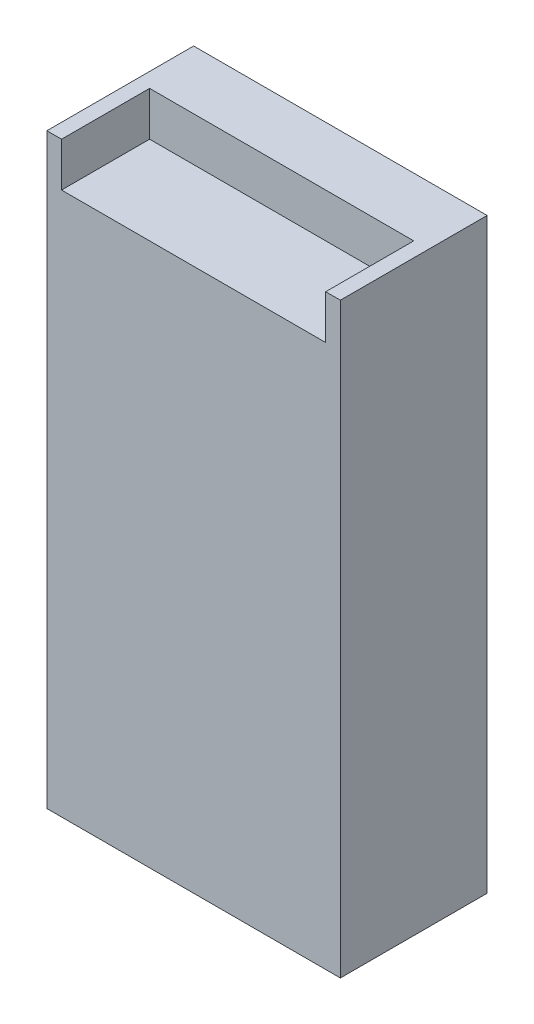
ISO-10303-21;
HEADER;
FILE_DESCRIPTION(('STEP AP214'),'2;1');
FILE_NAME('part.step','',(''),(''),'','','');
FILE_SCHEMA(('AUTOMOTIVE_DESIGN { 1 0 10303 214 1 1 1 1 }'));
ENDSEC;
DATA;
#1=APPLICATION_CONTEXT('core data for automotive mechanical design processes');
#2=APPLICATION_PROTOCOL_DEFINITION('international standard','automotive_design',2000,#1);
#3=PRODUCT_CONTEXT('',#1,'mechanical');
#4=PRODUCT('Part','Part','',(#3));
#5=PRODUCT_RELATED_PRODUCT_CATEGORY('part','',(#4));
#6=PRODUCT_DEFINITION_FORMATION('','',#4);
#7=PRODUCT_DEFINITION_CONTEXT('part definition',#1,'design');
#8=PRODUCT_DEFINITION('design','',#6,#7);
#9=PRODUCT_DEFINITION_SHAPE('','',#8);
#10=(LENGTH_UNIT() NAMED_UNIT(*) SI_UNIT(.MILLI.,.METRE.));
#11=(NAMED_UNIT(*) PLANE_ANGLE_UNIT() SI_UNIT($,.RADIAN.));
#12=(NAMED_UNIT(*) SI_UNIT($,.STERADIAN.) SOLID_ANGLE_UNIT());
#13=UNCERTAINTY_MEASURE_WITH_UNIT(LENGTH_MEASURE(1.E-05),#10,'distance_accuracy_value','');
#14=(GEOMETRIC_REPRESENTATION_CONTEXT(3) GLOBAL_UNCERTAINTY_ASSIGNED_CONTEXT((#13)) GLOBAL_UNIT_ASSIGNED_CONTEXT((#10,
#11,#12)) REPRESENTATION_CONTEXT('',''));
#15=CARTESIAN_POINT('',(0.,0.,0.));
#16=DIRECTION('',(0.,0.,1.));
#17=DIRECTION('',(1.,0.,0.));
#18=AXIS2_PLACEMENT_3D('',#15,#16,#17);
#19=CARTESIAN_POINT('',(0.,0.,50.));
#20=DIRECTION('',(1.,0.,0.));
#21=DIRECTION('',(0.,0.,-1.));
#22=AXIS2_PLACEMENT_3D('',#19,#20,#21);
#23=PLANE('',#22);
#24=DIRECTION('',(0.,-1.,0.));
#25=VECTOR('',#24,1.);
#26=CARTESIAN_POINT('',(0.,0.,0.));
#27=LINE('',#26,#25);
#28=CARTESIAN_POINT('',(0.,200.,0.));
#29=VERTEX_POINT('',#28);
#30=CARTESIAN_POINT('',(0.,0.,0.));
#31=VERTEX_POINT('',#30);
#32=EDGE_CURVE('E137',#29,#31,#27,.T.);
#33=ORIENTED_EDGE('',*,*,#32,.T.);
#34=DIRECTION('',(0.,0.,-1.));
#35=VECTOR('',#34,1.);
#36=CARTESIAN_POINT('',(0.,0.,50.));
#37=LINE('',#36,#35);
#38=CARTESIAN_POINT('',(0.,0.,50.));
#39=VERTEX_POINT('',#38);
#40=EDGE_CURVE('E11',#39,#31,#37,.T.);
#41=ORIENTED_EDGE('',*,*,#40,.F.);
#42=DIRECTION('',(0.,-1.,0.));
#43=VECTOR('',#42,1.);
#44=CARTESIAN_POINT('',(0.,0.,50.));
#45=LINE('',#44,#43);
#46=CARTESIAN_POINT('',(0.,200.,50.));
#47=VERTEX_POINT('',#46);
#48=EDGE_CURVE('E142',#47,#39,#45,.T.);
#49=ORIENTED_EDGE('',*,*,#48,.F.);
#50=DIRECTION('',(0.,0.,-1.));
#51=VECTOR('',#50,1.);
#52=CARTESIAN_POINT('',(0.,200.,50.));
#53=LINE('',#52,#51);
#54=EDGE_CURVE('E150',#47,#29,#53,.T.);
#55=ORIENTED_EDGE('',*,*,#54,.T.);
#56=EDGE_LOOP('',(#33,#41,#49,#55));
#57=FACE_BOUND('',#56,.T.);
#58=ADVANCED_FACE('F33',(#57),#23,.F.);
#59=CARTESIAN_POINT('',(0.,0.,50.));
#60=DIRECTION('',(0.,1.,0.));
#61=DIRECTION('',(0.,0.,1.));
#62=AXIS2_PLACEMENT_3D('',#59,#60,#61);
#63=PLANE('',#62);
#64=DIRECTION('',(1.,0.,0.));
#65=VECTOR('',#64,1.);
#66=CARTESIAN_POINT('',(0.,0.,0.));
#67=LINE('',#66,#65);
#68=CARTESIAN_POINT('',(100.,0.,0.));
#69=VERTEX_POINT('',#68);
#70=EDGE_CURVE('E153',#31,#69,#67,.T.);
#71=ORIENTED_EDGE('',*,*,#70,.T.);
#72=DIRECTION('',(0.,0.,-1.));
#73=VECTOR('',#72,1.);
#74=CARTESIAN_POINT('',(100.,0.,50.));
#75=LINE('',#74,#73);
#76=CARTESIAN_POINT('',(100.,0.,50.));
#77=VERTEX_POINT('',#76);
#78=EDGE_CURVE('E40',#77,#69,#75,.T.);
#79=ORIENTED_EDGE('',*,*,#78,.F.);
#80=DIRECTION('',(1.,0.,0.));
#81=VECTOR('',#80,1.);
#82=CARTESIAN_POINT('',(0.,0.,50.));
#83=LINE('',#82,#81);
#84=EDGE_CURVE('E84',#39,#77,#83,.T.);
#85=ORIENTED_EDGE('',*,*,#84,.F.);
#86=ORIENTED_EDGE('',*,*,#40,.T.);
#87=EDGE_LOOP('',(#71,#79,#85,#86));
#88=FACE_BOUND('',#87,.T.);
#89=ADVANCED_FACE('F188',(#88),#63,.F.);
#90=CARTESIAN_POINT('',(100.,0.,50.));
#91=DIRECTION('',(-1.,0.,0.));
#92=DIRECTION('',(0.,0.,1.));
#93=AXIS2_PLACEMENT_3D('',#90,#91,#92);
#94=PLANE('',#93);
#95=DIRECTION('',(0.,1.,0.));
#96=VECTOR('',#95,1.);
#97=CARTESIAN_POINT('',(100.,0.,0.));
#98=LINE('',#97,#96);
#99=CARTESIAN_POINT('',(100.,200.,0.));
#100=VERTEX_POINT('',#99);
#101=EDGE_CURVE('E155',#69,#100,#98,.T.);
#102=ORIENTED_EDGE('',*,*,#101,.T.);
#103=DIRECTION('',(0.,0.,-1.));
#104=VECTOR('',#103,1.);
#105=CARTESIAN_POINT('',(100.,200.,50.));
#106=LINE('',#105,#104);
#107=CARTESIAN_POINT('',(100.,200.,50.));
#108=VERTEX_POINT('',#107);
#109=EDGE_CURVE('E159',#108,#100,#106,.T.);
#110=ORIENTED_EDGE('',*,*,#109,.F.);
#111=DIRECTION('',(0.,1.,0.));
#112=VECTOR('',#111,1.);
#113=CARTESIAN_POINT('',(100.,0.,50.));
#114=LINE('',#113,#112);
#115=EDGE_CURVE('E145',#77,#108,#114,.T.);
#116=ORIENTED_EDGE('',*,*,#115,.F.);
#117=ORIENTED_EDGE('',*,*,#78,.T.);
#118=EDGE_LOOP('',(#102,#110,#116,#117));
#119=FACE_BOUND('',#118,.T.);
#120=ADVANCED_FACE('F164',(#119),#94,.F.);
#121=CARTESIAN_POINT('',(0.,200.,50.));
#122=DIRECTION('',(0.,-1.,0.));
#123=DIRECTION('',(0.,0.,-1.));
#124=AXIS2_PLACEMENT_3D('',#121,#122,#123);
#125=PLANE('',#124);
#126=DIRECTION('',(-1.,0.,0.));
#127=VECTOR('',#126,1.);
#128=CARTESIAN_POINT('',(0.,200.,50.));
#129=LINE('',#128,#127);
#130=CARTESIAN_POINT('',(5.,200.,50.));
#131=VERTEX_POINT('',#130);
#132=EDGE_CURVE('E55',#131,#47,#129,.T.);
#133=ORIENTED_EDGE('',*,*,#132,.F.);
#134=DIRECTION('',(0.,0.,1.));
#135=VECTOR('',#134,1.);
#136=CARTESIAN_POINT('',(5.,200.,20.));
#137=LINE('',#136,#135);
#138=CARTESIAN_POINT('',(5.,200.,20.));
#139=VERTEX_POINT('',#138);
#140=EDGE_CURVE('E135',#139,#131,#137,.T.);
#141=ORIENTED_EDGE('',*,*,#140,.F.);
#142=DIRECTION('',(-1.,0.,0.));
#143=VECTOR('',#142,1.);
#144=CARTESIAN_POINT('',(5.,200.,20.));
#145=LINE('',#144,#143);
#146=CARTESIAN_POINT('',(95.,200.,20.));
#147=VERTEX_POINT('',#146);
#148=EDGE_CURVE('E113',#147,#139,#145,.T.);
#149=ORIENTED_EDGE('',*,*,#148,.F.);
#150=DIRECTION('',(0.,0.,1.));
#151=VECTOR('',#150,1.);
#152=CARTESIAN_POINT('',(95.,200.,20.));
#153=LINE('',#152,#151);
#154=CARTESIAN_POINT('',(95.,200.,50.));
#155=VERTEX_POINT('',#154);
#156=EDGE_CURVE('E138',#147,#155,#153,.T.);
#157=ORIENTED_EDGE('',*,*,#156,.T.);
#158=EDGE_CURVE('E147',#108,#155,#129,.T.);
#159=ORIENTED_EDGE('',*,*,#158,.F.);
#160=ORIENTED_EDGE('',*,*,#109,.T.);
#161=DIRECTION('',(-1.,0.,0.));
#162=VECTOR('',#161,1.);
#163=CARTESIAN_POINT('',(0.,200.,0.));
#164=LINE('',#163,#162);
#165=EDGE_CURVE('E77',#100,#29,#164,.T.);
#166=ORIENTED_EDGE('',*,*,#165,.T.);
#167=ORIENTED_EDGE('',*,*,#54,.F.);
#168=EDGE_LOOP('',(#133,#141,#149,#157,#159,#160,#166,#167));
#169=FACE_BOUND('',#168,.T.);
#170=ADVANCED_FACE('F172',(#169),#125,.F.);
#171=CARTESIAN_POINT('',(0.,0.,50.));
#172=DIRECTION('',(0.,0.,-1.));
#173=DIRECTION('',(-1.,0.,0.));
#174=AXIS2_PLACEMENT_3D('',#171,#172,#173);
#175=PLANE('',#174);
#176=DIRECTION('',(1.,0.,0.));
#177=VECTOR('',#176,1.);
#178=CARTESIAN_POINT('',(5.,185.,50.));
#179=LINE('',#178,#177);
#180=CARTESIAN_POINT('',(5.,185.,50.));
#181=VERTEX_POINT('',#180);
#182=CARTESIAN_POINT('',(95.,185.,50.));
#183=VERTEX_POINT('',#182);
#184=EDGE_CURVE('E128',#181,#183,#179,.T.);
#185=ORIENTED_EDGE('',*,*,#184,.F.);
#186=DIRECTION('',(0.,-1.,0.));
#187=VECTOR('',#186,1.);
#188=CARTESIAN_POINT('',(5.,200.,50.));
#189=LINE('',#188,#187);
#190=EDGE_CURVE('E47',#131,#181,#189,.T.);
#191=ORIENTED_EDGE('',*,*,#190,.F.);
#192=ORIENTED_EDGE('',*,*,#132,.T.);
#193=ORIENTED_EDGE('',*,*,#48,.T.);
#194=ORIENTED_EDGE('',*,*,#84,.T.);
#195=ORIENTED_EDGE('',*,*,#115,.T.);
#196=ORIENTED_EDGE('',*,*,#158,.T.);
#197=DIRECTION('',(0.,1.,0.));
#198=VECTOR('',#197,1.);
#199=CARTESIAN_POINT('',(95.,200.,50.));
#200=LINE('',#199,#198);
#201=EDGE_CURVE('E126',#183,#155,#200,.T.);
#202=ORIENTED_EDGE('',*,*,#201,.F.);
#203=EDGE_LOOP('',(#185,#191,#192,#193,#194,#195,#196,#202));
#204=FACE_BOUND('',#203,.T.);
#205=ADVANCED_FACE('F173',(#204),#175,.F.);
#206=CARTESIAN_POINT('',(0.,0.,0.));
#207=DIRECTION('',(0.,0.,-1.));
#208=DIRECTION('',(-1.,0.,0.));
#209=AXIS2_PLACEMENT_3D('',#206,#207,#208);
#210=PLANE('',#209);
#211=ORIENTED_EDGE('',*,*,#32,.F.);
#212=ORIENTED_EDGE('',*,*,#165,.F.);
#213=ORIENTED_EDGE('',*,*,#101,.F.);
#214=ORIENTED_EDGE('',*,*,#70,.F.);
#215=EDGE_LOOP('',(#211,#212,#213,#214));
#216=FACE_BOUND('',#215,.T.);
#217=ADVANCED_FACE('F168',(#216),#210,.T.);
#218=CARTESIAN_POINT('',(5.,200.,20.));
#219=DIRECTION('',(-1.,0.,0.));
#220=DIRECTION('',(0.,-1.,0.));
#221=AXIS2_PLACEMENT_3D('',#218,#219,#220);
#222=PLANE('',#221);
#223=ORIENTED_EDGE('',*,*,#190,.T.);
#224=DIRECTION('',(0.,0.,1.));
#225=VECTOR('',#224,1.);
#226=CARTESIAN_POINT('',(5.,185.,20.));
#227=LINE('',#226,#225);
#228=CARTESIAN_POINT('',(5.,185.,20.));
#229=VERTEX_POINT('',#228);
#230=EDGE_CURVE('E103',#229,#181,#227,.T.);
#231=ORIENTED_EDGE('',*,*,#230,.F.);
#232=DIRECTION('',(0.,-1.,0.));
#233=VECTOR('',#232,1.);
#234=CARTESIAN_POINT('',(5.,200.,20.));
#235=LINE('',#234,#233);
#236=EDGE_CURVE('E107',#139,#229,#235,.T.);
#237=ORIENTED_EDGE('',*,*,#236,.F.);
#238=ORIENTED_EDGE('',*,*,#140,.T.);
#239=EDGE_LOOP('',(#223,#231,#237,#238));
#240=FACE_BOUND('',#239,.T.);
#241=ADVANCED_FACE('F105',(#240),#222,.F.);
#242=CARTESIAN_POINT('',(95.,200.,20.));
#243=DIRECTION('',(1.,0.,0.));
#244=DIRECTION('',(0.,0.,-1.));
#245=AXIS2_PLACEMENT_3D('',#242,#243,#244);
#246=PLANE('',#245);
#247=ORIENTED_EDGE('',*,*,#201,.T.);
#248=ORIENTED_EDGE('',*,*,#156,.F.);
#249=DIRECTION('',(0.,1.,0.));
#250=VECTOR('',#249,1.);
#251=CARTESIAN_POINT('',(95.,200.,20.));
#252=LINE('',#251,#250);
#253=CARTESIAN_POINT('',(95.,185.,20.));
#254=VERTEX_POINT('',#253);
#255=EDGE_CURVE('E121',#254,#147,#252,.T.);
#256=ORIENTED_EDGE('',*,*,#255,.F.);
#257=DIRECTION('',(0.,0.,1.));
#258=VECTOR('',#257,1.);
#259=CARTESIAN_POINT('',(95.,185.,20.));
#260=LINE('',#259,#258);
#261=EDGE_CURVE('E112',#254,#183,#260,.T.);
#262=ORIENTED_EDGE('',*,*,#261,.T.);
#263=EDGE_LOOP('',(#247,#248,#256,#262));
#264=FACE_BOUND('',#263,.T.);
#265=ADVANCED_FACE('F177',(#264),#246,.F.);
#266=CARTESIAN_POINT('',(5.,185.,20.));
#267=DIRECTION('',(0.,-1.,0.));
#268=DIRECTION('',(0.,0.,-1.));
#269=AXIS2_PLACEMENT_3D('',#266,#267,#268);
#270=PLANE('',#269);
#271=ORIENTED_EDGE('',*,*,#184,.T.);
#272=ORIENTED_EDGE('',*,*,#261,.F.);
#273=DIRECTION('',(1.,0.,0.));
#274=VECTOR('',#273,1.);
#275=CARTESIAN_POINT('',(5.,185.,20.));
#276=LINE('',#275,#274);
#277=EDGE_CURVE('E116',#229,#254,#276,.T.);
#278=ORIENTED_EDGE('',*,*,#277,.F.);
#279=ORIENTED_EDGE('',*,*,#230,.T.);
#280=EDGE_LOOP('',(#271,#272,#278,#279));
#281=FACE_BOUND('',#280,.T.);
#282=ADVANCED_FACE('F117',(#281),#270,.F.);
#283=CARTESIAN_POINT('',(0.,0.,20.));
#284=DIRECTION('',(0.,0.,1.));
#285=DIRECTION('',(1.,0.,0.));
#286=AXIS2_PLACEMENT_3D('',#283,#284,#285);
#287=PLANE('',#286);
#288=ORIENTED_EDGE('',*,*,#236,.T.);
#289=ORIENTED_EDGE('',*,*,#277,.T.);
#290=ORIENTED_EDGE('',*,*,#255,.T.);
#291=ORIENTED_EDGE('',*,*,#148,.T.);
#292=EDGE_LOOP('',(#288,#289,#290,#291));
#293=FACE_BOUND('',#292,.T.);
#294=ADVANCED_FACE('F123',(#293),#287,.T.);
#295=CLOSED_SHELL('',(#58,#89,#120,#170,#205,#217,#241,#265,#282,#294));
#296=MANIFOLD_SOLID_BREP('B2',#295);
#297=ADVANCED_BREP_SHAPE_REPRESENTATION('',(#18,#296),#14);
#298=SHAPE_DEFINITION_REPRESENTATION(#9,#297);
ENDSEC;
END-ISO-10303-21;
